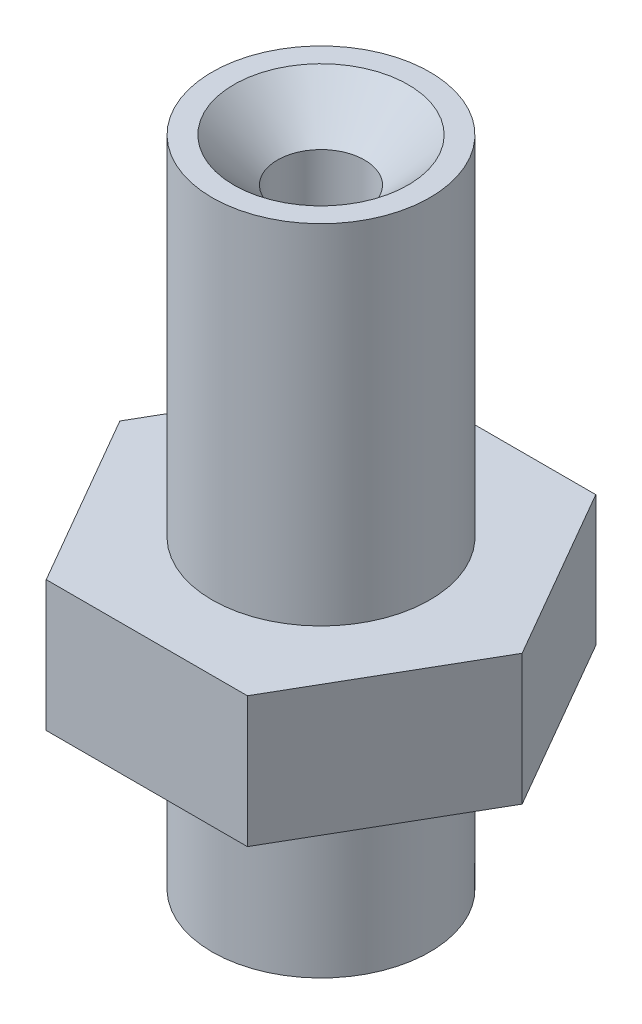
ISO-10303-21;
HEADER;
FILE_DESCRIPTION(('STEP AP214'),'2;1');
FILE_NAME('part.step','',(''),(''),'','','');
FILE_SCHEMA(('AUTOMOTIVE_DESIGN { 1 0 10303 214 1 1 1 1 }'));
ENDSEC;
DATA;
#1=APPLICATION_CONTEXT('core data for automotive mechanical design processes');
#2=APPLICATION_PROTOCOL_DEFINITION('international standard','automotive_design',2000,#1);
#3=PRODUCT_CONTEXT('',#1,'mechanical');
#4=PRODUCT('Part','Part','',(#3));
#5=PRODUCT_RELATED_PRODUCT_CATEGORY('part','',(#4));
#6=PRODUCT_DEFINITION_FORMATION('','',#4);
#7=PRODUCT_DEFINITION_CONTEXT('part definition',#1,'design');
#8=PRODUCT_DEFINITION('design','',#6,#7);
#9=PRODUCT_DEFINITION_SHAPE('','',#8);
#10=(LENGTH_UNIT() NAMED_UNIT(*) SI_UNIT(.MILLI.,.METRE.));
#11=(NAMED_UNIT(*) PLANE_ANGLE_UNIT() SI_UNIT($,.RADIAN.));
#12=(NAMED_UNIT(*) SI_UNIT($,.STERADIAN.) SOLID_ANGLE_UNIT());
#13=UNCERTAINTY_MEASURE_WITH_UNIT(LENGTH_MEASURE(1.E-05),#10,'distance_accuracy_value','');
#14=(GEOMETRIC_REPRESENTATION_CONTEXT(3) GLOBAL_UNCERTAINTY_ASSIGNED_CONTEXT((#13)) GLOBAL_UNIT_ASSIGNED_CONTEXT((#10,
#11,#12)) REPRESENTATION_CONTEXT('',''));
#15=CARTESIAN_POINT('',(0.,0.,0.));
#16=DIRECTION('',(0.,0.,1.));
#17=DIRECTION('',(1.,0.,0.));
#18=AXIS2_PLACEMENT_3D('',#15,#16,#17);
#19=CARTESIAN_POINT('',(0.,1.5,0.));
#20=DIRECTION('',(0.,1.,0.));
#21=DIRECTION('',(0.,0.,1.));
#22=AXIS2_PLACEMENT_3D('',#19,#20,#21);
#23=PLANE('',#22);
#24=DIRECTION('',(-0.500000000000001,0.,-0.866025403784438));
#25=VECTOR('',#24,1.);
#26=CARTESIAN_POINT('',(4.61880215351701,1.5,0.));
#27=LINE('',#26,#25);
#28=CARTESIAN_POINT('',(4.61880215351701,1.5,0.));
#29=VERTEX_POINT('',#28);
#30=CARTESIAN_POINT('',(2.3094010767585,1.5,-4.));
#31=VERTEX_POINT('',#30);
#32=EDGE_CURVE('E134',#29,#31,#27,.T.);
#33=ORIENTED_EDGE('',*,*,#32,.T.);
#34=DIRECTION('',(-1.,0.,0.));
#35=VECTOR('',#34,1.);
#36=CARTESIAN_POINT('',(2.3094010767585,1.5,-4.));
#37=LINE('',#36,#35);
#38=CARTESIAN_POINT('',(-2.3094010767585,1.5,-4.));
#39=VERTEX_POINT('',#38);
#40=EDGE_CURVE('E92',#31,#39,#37,.T.);
#41=ORIENTED_EDGE('',*,*,#40,.T.);
#42=DIRECTION('',(-0.499999999999999,0.,0.866025403784439));
#43=VECTOR('',#42,1.);
#44=CARTESIAN_POINT('',(-2.3094010767585,1.5,-4.));
#45=LINE('',#44,#43);
#46=CARTESIAN_POINT('',(-4.618802153517,1.5,0.));
#47=VERTEX_POINT('',#46);
#48=EDGE_CURVE('E105',#39,#47,#45,.T.);
#49=ORIENTED_EDGE('',*,*,#48,.T.);
#50=DIRECTION('',(0.500000000000001,0.,0.866025403784438));
#51=VECTOR('',#50,1.);
#52=CARTESIAN_POINT('',(-4.618802153517,1.5,0.));
#53=LINE('',#52,#51);
#54=CARTESIAN_POINT('',(-2.3094010767585,1.5,4.));
#55=VERTEX_POINT('',#54);
#56=EDGE_CURVE('E99',#47,#55,#53,.T.);
#57=ORIENTED_EDGE('',*,*,#56,.T.);
#58=DIRECTION('',(1.,0.,0.));
#59=VECTOR('',#58,1.);
#60=CARTESIAN_POINT('',(-2.3094010767585,1.5,4.));
#61=LINE('',#60,#59);
#62=CARTESIAN_POINT('',(2.3094010767585,1.5,4.));
#63=VERTEX_POINT('',#62);
#64=EDGE_CURVE('E103',#55,#63,#61,.T.);
#65=ORIENTED_EDGE('',*,*,#64,.T.);
#66=DIRECTION('',(0.5,0.,-0.866025403784439));
#67=VECTOR('',#66,1.);
#68=CARTESIAN_POINT('',(2.3094010767585,1.5,4.));
#69=LINE('',#68,#67);
#70=EDGE_CURVE('E54',#63,#29,#69,.T.);
#71=ORIENTED_EDGE('',*,*,#70,.T.);
#72=EDGE_LOOP('',(#33,#41,#49,#57,#65,#71));
#73=FACE_BOUND('',#72,.T.);
#74=CARTESIAN_POINT('',(0.,1.5,0.));
#75=DIRECTION('',(0.,1.,0.));
#76=DIRECTION('',(0.,0.,1.));
#77=AXIS2_PLACEMENT_3D('',#74,#75,#76);
#78=CIRCLE('',#77,2.5);
#79=CARTESIAN_POINT('',(0.,1.5,2.5));
#80=VERTEX_POINT('',#79);
#81=EDGE_CURVE('E184',#80,#80,#78,.T.);
#82=ORIENTED_EDGE('',*,*,#81,.F.);
#83=EDGE_LOOP('',(#82));
#84=FACE_BOUND('',#83,.T.);
#85=ADVANCED_FACE('F37',(#73,#84),#23,.T.);
#86=CARTESIAN_POINT('',(0.,-1.5,0.));
#87=DIRECTION('',(0.,1.,0.));
#88=DIRECTION('',(0.,0.,1.));
#89=AXIS2_PLACEMENT_3D('',#86,#87,#88);
#90=PLANE('',#89);
#91=DIRECTION('',(-0.500000000000001,0.,-0.866025403784438));
#92=VECTOR('',#91,1.);
#93=CARTESIAN_POINT('',(4.61880215351701,-1.5,0.));
#94=LINE('',#93,#92);
#95=CARTESIAN_POINT('',(4.61880215351701,-1.5,0.));
#96=VERTEX_POINT('',#95);
#97=CARTESIAN_POINT('',(2.3094010767585,-1.5,-4.));
#98=VERTEX_POINT('',#97);
#99=EDGE_CURVE('E123',#96,#98,#94,.T.);
#100=ORIENTED_EDGE('',*,*,#99,.F.);
#101=DIRECTION('',(0.5,0.,-0.866025403784439));
#102=VECTOR('',#101,1.);
#103=CARTESIAN_POINT('',(2.3094010767585,-1.5,4.));
#104=LINE('',#103,#102);
#105=CARTESIAN_POINT('',(2.3094010767585,-1.5,4.));
#106=VERTEX_POINT('',#105);
#107=EDGE_CURVE('E83',#106,#96,#104,.T.);
#108=ORIENTED_EDGE('',*,*,#107,.F.);
#109=DIRECTION('',(1.,0.,0.));
#110=VECTOR('',#109,1.);
#111=CARTESIAN_POINT('',(-2.3094010767585,-1.5,4.));
#112=LINE('',#111,#110);
#113=CARTESIAN_POINT('',(-2.3094010767585,-1.5,4.));
#114=VERTEX_POINT('',#113);
#115=EDGE_CURVE('E77',#114,#106,#112,.T.);
#116=ORIENTED_EDGE('',*,*,#115,.F.);
#117=DIRECTION('',(0.500000000000001,0.,0.866025403784438));
#118=VECTOR('',#117,1.);
#119=CARTESIAN_POINT('',(-4.618802153517,-1.5,0.));
#120=LINE('',#119,#118);
#121=CARTESIAN_POINT('',(-4.618802153517,-1.5,0.));
#122=VERTEX_POINT('',#121);
#123=EDGE_CURVE('E113',#122,#114,#120,.T.);
#124=ORIENTED_EDGE('',*,*,#123,.F.);
#125=DIRECTION('',(-0.499999999999999,0.,0.866025403784439));
#126=VECTOR('',#125,1.);
#127=CARTESIAN_POINT('',(-2.3094010767585,-1.5,-4.));
#128=LINE('',#127,#126);
#129=CARTESIAN_POINT('',(-2.3094010767585,-1.5,-4.));
#130=VERTEX_POINT('',#129);
#131=EDGE_CURVE('E129',#130,#122,#128,.T.);
#132=ORIENTED_EDGE('',*,*,#131,.F.);
#133=DIRECTION('',(-1.,0.,0.));
#134=VECTOR('',#133,1.);
#135=CARTESIAN_POINT('',(2.3094010767585,-1.5,-4.));
#136=LINE('',#135,#134);
#137=EDGE_CURVE('E126',#98,#130,#136,.T.);
#138=ORIENTED_EDGE('',*,*,#137,.F.);
#139=EDGE_LOOP('',(#100,#108,#116,#124,#132,#138));
#140=FACE_BOUND('',#139,.T.);
#141=CARTESIAN_POINT('',(0.,-1.5,0.));
#142=DIRECTION('',(0.,1.,0.));
#143=DIRECTION('',(0.,0.,1.));
#144=AXIS2_PLACEMENT_3D('',#141,#142,#143);
#145=CIRCLE('',#144,2.5);
#146=CARTESIAN_POINT('',(0.,-1.5,2.5));
#147=VERTEX_POINT('',#146);
#148=EDGE_CURVE('E143',#147,#147,#145,.F.);
#149=ORIENTED_EDGE('',*,*,#148,.F.);
#150=EDGE_LOOP('',(#149));
#151=FACE_BOUND('',#150,.T.);
#152=ADVANCED_FACE('F197',(#140,#151),#90,.F.);
#153=CARTESIAN_POINT('',(4.61880215351701,1.5,0.));
#154=DIRECTION('',(-0.866025403784438,0.,0.500000000000001));
#155=DIRECTION('',(0.500000000000001,0.,0.866025403784438));
#156=AXIS2_PLACEMENT_3D('',#153,#154,#155);
#157=PLANE('',#156);
#158=ORIENTED_EDGE('',*,*,#99,.T.);
#159=DIRECTION('',(0.,-1.,0.));
#160=VECTOR('',#159,1.);
#161=CARTESIAN_POINT('',(2.3094010767585,1.5,-4.));
#162=LINE('',#161,#160);
#163=EDGE_CURVE('E141',#31,#98,#162,.T.);
#164=ORIENTED_EDGE('',*,*,#163,.F.);
#165=ORIENTED_EDGE('',*,*,#32,.F.);
#166=DIRECTION('',(0.,-1.,0.));
#167=VECTOR('',#166,1.);
#168=CARTESIAN_POINT('',(4.61880215351701,1.5,0.));
#169=LINE('',#168,#167);
#170=EDGE_CURVE('E119',#29,#96,#169,.T.);
#171=ORIENTED_EDGE('',*,*,#170,.T.);
#172=EDGE_LOOP('',(#158,#164,#165,#171));
#173=FACE_BOUND('',#172,.T.);
#174=ADVANCED_FACE('F200',(#173),#157,.F.);
#175=CARTESIAN_POINT('',(2.3094010767585,1.5,-4.));
#176=DIRECTION('',(0.,0.,1.));
#177=DIRECTION('',(1.,0.,0.));
#178=AXIS2_PLACEMENT_3D('',#175,#176,#177);
#179=PLANE('',#178);
#180=ORIENTED_EDGE('',*,*,#137,.T.);
#181=DIRECTION('',(0.,-1.,0.));
#182=VECTOR('',#181,1.);
#183=CARTESIAN_POINT('',(-2.3094010767585,1.5,-4.));
#184=LINE('',#183,#182);
#185=EDGE_CURVE('E138',#39,#130,#184,.T.);
#186=ORIENTED_EDGE('',*,*,#185,.F.);
#187=ORIENTED_EDGE('',*,*,#40,.F.);
#188=ORIENTED_EDGE('',*,*,#163,.T.);
#189=EDGE_LOOP('',(#180,#186,#187,#188));
#190=FACE_BOUND('',#189,.T.);
#191=ADVANCED_FACE('F191',(#190),#179,.F.);
#192=CARTESIAN_POINT('',(-2.3094010767585,1.5,-4.));
#193=DIRECTION('',(0.866025403784439,0.,0.499999999999999));
#194=DIRECTION('',(0.5,0.,-0.866025403784439));
#195=AXIS2_PLACEMENT_3D('',#192,#193,#194);
#196=PLANE('',#195);
#197=ORIENTED_EDGE('',*,*,#131,.T.);
#198=DIRECTION('',(0.,-1.,0.));
#199=VECTOR('',#198,1.);
#200=CARTESIAN_POINT('',(-4.618802153517,1.5,0.));
#201=LINE('',#200,#199);
#202=EDGE_CURVE('E114',#47,#122,#201,.T.);
#203=ORIENTED_EDGE('',*,*,#202,.F.);
#204=ORIENTED_EDGE('',*,*,#48,.F.);
#205=ORIENTED_EDGE('',*,*,#185,.T.);
#206=EDGE_LOOP('',(#197,#203,#204,#205));
#207=FACE_BOUND('',#206,.T.);
#208=ADVANCED_FACE('F194',(#207),#196,.F.);
#209=CARTESIAN_POINT('',(-4.618802153517,1.5,0.));
#210=DIRECTION('',(0.866025403784438,0.,-0.500000000000001));
#211=DIRECTION('',(-0.500000000000001,0.,-0.866025403784438));
#212=AXIS2_PLACEMENT_3D('',#209,#210,#211);
#213=PLANE('',#212);
#214=ORIENTED_EDGE('',*,*,#123,.T.);
#215=DIRECTION('',(0.,-1.,0.));
#216=VECTOR('',#215,1.);
#217=CARTESIAN_POINT('',(-2.3094010767585,1.5,4.));
#218=LINE('',#217,#216);
#219=EDGE_CURVE('E110',#55,#114,#218,.T.);
#220=ORIENTED_EDGE('',*,*,#219,.F.);
#221=ORIENTED_EDGE('',*,*,#56,.F.);
#222=ORIENTED_EDGE('',*,*,#202,.T.);
#223=EDGE_LOOP('',(#214,#220,#221,#222));
#224=FACE_BOUND('',#223,.T.);
#225=ADVANCED_FACE('F111',(#224),#213,.F.);
#226=CARTESIAN_POINT('',(-2.3094010767585,1.5,4.));
#227=DIRECTION('',(0.,0.,-1.));
#228=DIRECTION('',(-1.,0.,0.));
#229=AXIS2_PLACEMENT_3D('',#226,#227,#228);
#230=PLANE('',#229);
#231=ORIENTED_EDGE('',*,*,#115,.T.);
#232=DIRECTION('',(0.,-1.,0.));
#233=VECTOR('',#232,1.);
#234=CARTESIAN_POINT('',(2.3094010767585,1.5,4.));
#235=LINE('',#234,#233);
#236=EDGE_CURVE('E115',#63,#106,#235,.T.);
#237=ORIENTED_EDGE('',*,*,#236,.F.);
#238=ORIENTED_EDGE('',*,*,#64,.F.);
#239=ORIENTED_EDGE('',*,*,#219,.T.);
#240=EDGE_LOOP('',(#231,#237,#238,#239));
#241=FACE_BOUND('',#240,.T.);
#242=ADVANCED_FACE('F117',(#241),#230,.F.);
#243=CARTESIAN_POINT('',(2.3094010767585,1.5,4.));
#244=DIRECTION('',(-0.866025403784439,0.,-0.5));
#245=DIRECTION('',(-0.5,0.,0.866025403784439));
#246=AXIS2_PLACEMENT_3D('',#243,#244,#245);
#247=PLANE('',#246);
#248=ORIENTED_EDGE('',*,*,#107,.T.);
#249=ORIENTED_EDGE('',*,*,#170,.F.);
#250=ORIENTED_EDGE('',*,*,#70,.F.);
#251=ORIENTED_EDGE('',*,*,#236,.T.);
#252=EDGE_LOOP('',(#248,#249,#250,#251));
#253=FACE_BOUND('',#252,.T.);
#254=ADVANCED_FACE('F201',(#253),#247,.F.);
#255=CARTESIAN_POINT('',(0.,-5.5,0.));
#256=DIRECTION('',(0.,1.,0.));
#257=DIRECTION('',(0.,0.,1.));
#258=AXIS2_PLACEMENT_3D('',#255,#256,#257);
#259=CYLINDRICAL_SURFACE('',#258,2.5);
#260=CARTESIAN_POINT('',(0.,-5.5,0.));
#261=DIRECTION('',(0.,-1.,0.));
#262=DIRECTION('',(0.,0.,-1.));
#263=AXIS2_PLACEMENT_3D('',#260,#261,#262);
#264=CIRCLE('',#263,2.5);
#265=CARTESIAN_POINT('',(0.,-5.5,-2.5));
#266=VERTEX_POINT('',#265);
#267=EDGE_CURVE('E127',#266,#266,#264,.T.);
#268=ORIENTED_EDGE('',*,*,#267,.F.);
#269=EDGE_LOOP('',(#268));
#270=FACE_BOUND('',#269,.T.);
#271=ORIENTED_EDGE('',*,*,#148,.T.);
#272=EDGE_LOOP('',(#271));
#273=FACE_BOUND('',#272,.T.);
#274=ADVANCED_FACE('F176',(#270,#273),#259,.T.);
#275=CARTESIAN_POINT('',(0.,-5.5,0.));
#276=DIRECTION('',(0.,-1.,0.));
#277=DIRECTION('',(0.,0.,-1.));
#278=AXIS2_PLACEMENT_3D('',#275,#276,#277);
#279=PLANE('',#278);
#280=CARTESIAN_POINT('',(0.,-5.5,0.));
#281=DIRECTION('',(0.,-1.,0.));
#282=DIRECTION('',(0.,0.,-1.));
#283=AXIS2_PLACEMENT_3D('',#280,#281,#282);
#284=CIRCLE('',#283,2.);
#285=CARTESIAN_POINT('',(0.,-5.5,-2.));
#286=VERTEX_POINT('',#285);
#287=EDGE_CURVE('E11',#286,#286,#284,.F.);
#288=ORIENTED_EDGE('',*,*,#287,.T.);
#289=EDGE_LOOP('',(#288));
#290=FACE_BOUND('',#289,.T.);
#291=ORIENTED_EDGE('',*,*,#267,.T.);
#292=EDGE_LOOP('',(#291));
#293=FACE_BOUND('',#292,.T.);
#294=ADVANCED_FACE('F172',(#290,#293),#279,.T.);
#295=CARTESIAN_POINT('',(0.,9.5,0.));
#296=DIRECTION('',(0.,-1.,0.));
#297=DIRECTION('',(0.,0.,-1.));
#298=AXIS2_PLACEMENT_3D('',#295,#296,#297);
#299=CYLINDRICAL_SURFACE('',#298,2.5);
#300=CARTESIAN_POINT('',(0.,9.5,0.));
#301=DIRECTION('',(0.,1.,0.));
#302=DIRECTION('',(0.,0.,1.));
#303=AXIS2_PLACEMENT_3D('',#300,#301,#302);
#304=CIRCLE('',#303,2.5);
#305=CARTESIAN_POINT('',(0.,9.5,2.5));
#306=VERTEX_POINT('',#305);
#307=EDGE_CURVE('E181',#306,#306,#304,.T.);
#308=ORIENTED_EDGE('',*,*,#307,.F.);
#309=EDGE_LOOP('',(#308));
#310=FACE_BOUND('',#309,.T.);
#311=ORIENTED_EDGE('',*,*,#81,.T.);
#312=EDGE_LOOP('',(#311));
#313=FACE_BOUND('',#312,.T.);
#314=ADVANCED_FACE('F175',(#310,#313),#299,.T.);
#315=CARTESIAN_POINT('',(0.,9.5,0.));
#316=DIRECTION('',(0.,1.,0.));
#317=DIRECTION('',(0.,0.,1.));
#318=AXIS2_PLACEMENT_3D('',#315,#316,#317);
#319=PLANE('',#318);
#320=CARTESIAN_POINT('',(0.,9.5,0.));
#321=DIRECTION('',(0.,1.,0.));
#322=DIRECTION('',(0.,0.,1.));
#323=AXIS2_PLACEMENT_3D('',#320,#321,#322);
#324=CIRCLE('',#323,2.);
#325=CARTESIAN_POINT('',(0.,9.5,2.));
#326=VERTEX_POINT('',#325);
#327=EDGE_CURVE('E46',#326,#326,#324,.F.);
#328=ORIENTED_EDGE('',*,*,#327,.T.);
#329=EDGE_LOOP('',(#328));
#330=FACE_BOUND('',#329,.T.);
#331=ORIENTED_EDGE('',*,*,#307,.T.);
#332=EDGE_LOOP('',(#331));
#333=FACE_BOUND('',#332,.T.);
#334=ADVANCED_FACE('F154',(#330,#333),#319,.T.);
#335=CARTESIAN_POINT('',(0.,-5.5,0.));
#336=DIRECTION('',(0.,1.,0.));
#337=DIRECTION('',(0.,0.,1.));
#338=AXIS2_PLACEMENT_3D('',#335,#336,#337);
#339=CYLINDRICAL_SURFACE('',#338,1.);
#340=CARTESIAN_POINT('',(0.,8.5,0.));
#341=DIRECTION('',(0.,1.,0.));
#342=DIRECTION('',(0.,0.,1.));
#343=AXIS2_PLACEMENT_3D('',#340,#341,#342);
#344=CIRCLE('',#343,1.);
#345=CARTESIAN_POINT('',(0.,8.5,1.));
#346=VERTEX_POINT('',#345);
#347=EDGE_CURVE('E149',#346,#346,#344,.T.);
#348=ORIENTED_EDGE('',*,*,#347,.T.);
#349=EDGE_LOOP('',(#348));
#350=FACE_BOUND('',#349,.T.);
#351=CARTESIAN_POINT('',(0.,-4.49999999999999,0.));
#352=DIRECTION('',(0.,-1.,0.));
#353=DIRECTION('',(0.,0.,-1.));
#354=AXIS2_PLACEMENT_3D('',#351,#352,#353);
#355=CIRCLE('',#354,1.);
#356=CARTESIAN_POINT('',(0.,-4.49999999999999,-1.));
#357=VERTEX_POINT('',#356);
#358=EDGE_CURVE('E146',#357,#357,#355,.T.);
#359=ORIENTED_EDGE('',*,*,#358,.T.);
#360=EDGE_LOOP('',(#359));
#361=FACE_BOUND('',#360,.T.);
#362=ADVANCED_FACE('F160',(#350,#361),#339,.F.);
#363=CARTESIAN_POINT('',(0.,8.5,0.));
#364=DIRECTION('',(0.,1.,0.));
#365=DIRECTION('',(0.,0.,1.));
#366=AXIS2_PLACEMENT_3D('',#363,#364,#365);
#367=CONICAL_SURFACE('',#366,1.,0.785398163397451);
#368=ORIENTED_EDGE('',*,*,#327,.F.);
#369=EDGE_LOOP('',(#368));
#370=FACE_BOUND('',#369,.T.);
#371=ORIENTED_EDGE('',*,*,#347,.F.);
#372=EDGE_LOOP('',(#371));
#373=FACE_BOUND('',#372,.T.);
#374=ADVANCED_FACE('F157',(#370,#373),#367,.F.);
#375=CARTESIAN_POINT('',(0.,-5.5,0.));
#376=DIRECTION('',(0.,-1.,0.));
#377=DIRECTION('',(0.,0.,-1.));
#378=AXIS2_PLACEMENT_3D('',#375,#376,#377);
#379=CONICAL_SURFACE('',#378,2.,0.785398163397447);
#380=ORIENTED_EDGE('',*,*,#358,.F.);
#381=EDGE_LOOP('',(#380));
#382=FACE_BOUND('',#381,.T.);
#383=ORIENTED_EDGE('',*,*,#287,.F.);
#384=EDGE_LOOP('',(#383));
#385=FACE_BOUND('',#384,.T.);
#386=ADVANCED_FACE('F39',(#382,#385),#379,.F.);
#387=CLOSED_SHELL('',(#85,#152,#174,#191,#208,#225,#242,#254,#274,#294,#314,#334,#362,#374,#386));
#388=MANIFOLD_SOLID_BREP('B2',#387);
#389=ADVANCED_BREP_SHAPE_REPRESENTATION('',(#18,#388),#14);
#390=SHAPE_DEFINITION_REPRESENTATION(#9,#389);
ENDSEC;
END-ISO-10303-21;
